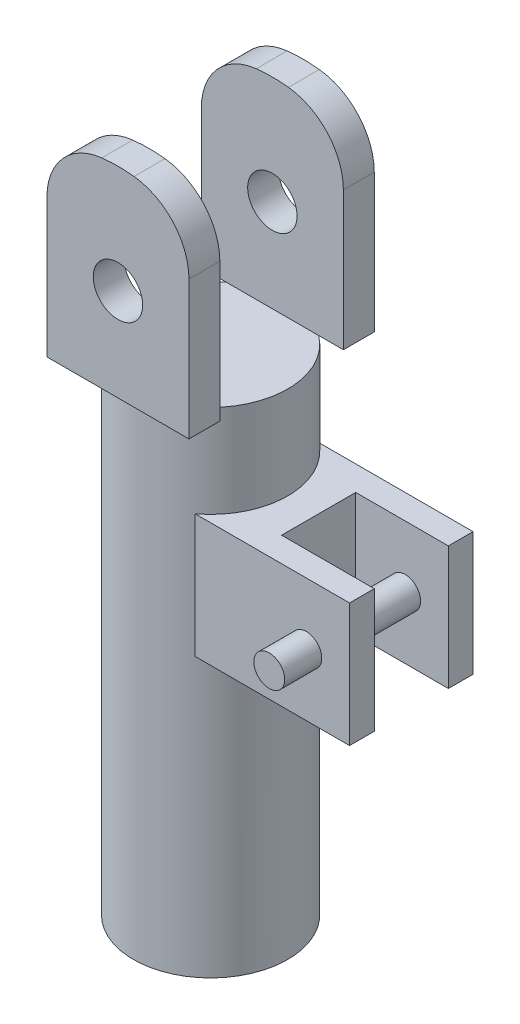
ISO-10303-21;
HEADER;
FILE_DESCRIPTION(('STEP AP214'),'2;1');
FILE_NAME('part.step','',(''),(''),'','','');
FILE_SCHEMA(('AUTOMOTIVE_DESIGN { 1 0 10303 214 1 1 1 1 }'));
ENDSEC;
DATA;
#1=APPLICATION_CONTEXT('core data for automotive mechanical design processes');
#2=APPLICATION_PROTOCOL_DEFINITION('international standard','automotive_design',2000,#1);
#3=PRODUCT_CONTEXT('',#1,'mechanical');
#4=PRODUCT('Part','Part','',(#3));
#5=PRODUCT_RELATED_PRODUCT_CATEGORY('part','',(#4));
#6=PRODUCT_DEFINITION_FORMATION('','',#4);
#7=PRODUCT_DEFINITION_CONTEXT('part definition',#1,'design');
#8=PRODUCT_DEFINITION('design','',#6,#7);
#9=PRODUCT_DEFINITION_SHAPE('','',#8);
#10=(LENGTH_UNIT() NAMED_UNIT(*) SI_UNIT(.MILLI.,.METRE.));
#11=(NAMED_UNIT(*) PLANE_ANGLE_UNIT() SI_UNIT($,.RADIAN.));
#12=(NAMED_UNIT(*) SI_UNIT($,.STERADIAN.) SOLID_ANGLE_UNIT());
#13=UNCERTAINTY_MEASURE_WITH_UNIT(LENGTH_MEASURE(1.E-05),#10,'distance_accuracy_value','');
#14=(GEOMETRIC_REPRESENTATION_CONTEXT(3) GLOBAL_UNCERTAINTY_ASSIGNED_CONTEXT((#13)) GLOBAL_UNIT_ASSIGNED_CONTEXT((#10,
#11,#12)) REPRESENTATION_CONTEXT('',''));
#15=CARTESIAN_POINT('',(0.,0.,0.));
#16=DIRECTION('',(0.,0.,1.));
#17=DIRECTION('',(1.,0.,0.));
#18=AXIS2_PLACEMENT_3D('',#15,#16,#17);
#19=CARTESIAN_POINT('',(32.5,0.,10.));
#20=DIRECTION('',(-1.,0.,0.));
#21=DIRECTION('',(0.,0.,1.));
#22=AXIS2_PLACEMENT_3D('',#19,#20,#21);
#23=PLANE('',#22);
#24=DIRECTION('',(0.,0.,-1.));
#25=VECTOR('',#24,1.);
#26=CARTESIAN_POINT('',(32.5,0.,10.));
#27=LINE('',#26,#25);
#28=CARTESIAN_POINT('',(32.5,0.,10.));
#29=VERTEX_POINT('',#28);
#30=CARTESIAN_POINT('',(32.5,0.,6.));
#31=VERTEX_POINT('',#30);
#32=EDGE_CURVE('E232',#29,#31,#27,.T.);
#33=ORIENTED_EDGE('',*,*,#32,.T.);
#34=DIRECTION('',(0.,1.,0.));
#35=VECTOR('',#34,1.);
#36=CARTESIAN_POINT('',(32.5,0.,6.));
#37=LINE('',#36,#35);
#38=CARTESIAN_POINT('',(32.5,20.,6.));
#39=VERTEX_POINT('',#38);
#40=EDGE_CURVE('E217',#31,#39,#37,.T.);
#41=ORIENTED_EDGE('',*,*,#40,.T.);
#42=DIRECTION('',(0.,0.,-1.));
#43=VECTOR('',#42,1.);
#44=CARTESIAN_POINT('',(32.5,20.,10.));
#45=LINE('',#44,#43);
#46=CARTESIAN_POINT('',(32.5,20.,10.));
#47=VERTEX_POINT('',#46);
#48=EDGE_CURVE('E229',#47,#39,#45,.T.);
#49=ORIENTED_EDGE('',*,*,#48,.F.);
#50=DIRECTION('',(0.,1.,0.));
#51=VECTOR('',#50,1.);
#52=CARTESIAN_POINT('',(32.5,0.,10.));
#53=LINE('',#52,#51);
#54=EDGE_CURVE('E223',#29,#47,#53,.T.);
#55=ORIENTED_EDGE('',*,*,#54,.F.);
#56=EDGE_LOOP('',(#33,#41,#49,#55));
#57=FACE_BOUND('',#56,.T.);
#58=ADVANCED_FACE('F34',(#57),#23,.F.);
#59=CARTESIAN_POINT('',(0.,35.,0.));
#60=DIRECTION('',(0.,-1.,0.));
#61=DIRECTION('',(0.,0.,-1.));
#62=AXIS2_PLACEMENT_3D('',#59,#60,#61);
#63=CYLINDRICAL_SURFACE('',#62,12.5);
#64=CARTESIAN_POINT('',(0.,-45.,0.));
#65=DIRECTION('',(0.,-1.,0.));
#66=DIRECTION('',(0.,0.,-1.));
#67=AXIS2_PLACEMENT_3D('',#64,#65,#66);
#68=CIRCLE('',#67,12.5);
#69=CARTESIAN_POINT('',(0.,-45.,-12.5));
#70=VERTEX_POINT('',#69);
#71=EDGE_CURVE('E254',#70,#70,#68,.T.);
#72=ORIENTED_EDGE('',*,*,#71,.F.);
#73=EDGE_LOOP('',(#72));
#74=FACE_BOUND('',#73,.T.);
#75=CARTESIAN_POINT('',(0.,35.,0.));
#76=DIRECTION('',(0.,1.,0.));
#77=DIRECTION('',(0.,0.,1.));
#78=AXIS2_PLACEMENT_3D('',#75,#76,#77);
#79=CIRCLE('',#78,12.5);
#80=CARTESIAN_POINT('',(7.5,35.,10.));
#81=VERTEX_POINT('',#80);
#82=CARTESIAN_POINT('',(7.5,35.,-10.));
#83=VERTEX_POINT('',#82);
#84=EDGE_CURVE('E11',#81,#83,#79,.T.);
#85=ORIENTED_EDGE('',*,*,#84,.F.);
#86=CARTESIAN_POINT('',(-7.5,35.,10.));
#87=VERTEX_POINT('',#86);
#88=EDGE_CURVE('E357',#87,#81,#79,.T.);
#89=ORIENTED_EDGE('',*,*,#88,.F.);
#90=CARTESIAN_POINT('',(-7.5,35.,-10.));
#91=VERTEX_POINT('',#90);
#92=EDGE_CURVE('E45',#91,#87,#79,.T.);
#93=ORIENTED_EDGE('',*,*,#92,.F.);
#94=EDGE_CURVE('E43',#83,#91,#79,.T.);
#95=ORIENTED_EDGE('',*,*,#94,.F.);
#96=EDGE_LOOP('',(#85,#89,#93,#95));
#97=FACE_BOUND('',#96,.T.);
#98=DIRECTION('',(0.,-1.,0.));
#99=VECTOR('',#98,1.);
#100=CARTESIAN_POINT('',(7.5,35.,-10.));
#101=LINE('',#100,#99);
#102=CARTESIAN_POINT('',(7.5,20.,-10.));
#103=VERTEX_POINT('',#102);
#104=CARTESIAN_POINT('',(7.5,0.,-10.));
#105=VERTEX_POINT('',#104);
#106=EDGE_CURVE('E236',#103,#105,#101,.T.);
#107=ORIENTED_EDGE('',*,*,#106,.T.);
#108=CARTESIAN_POINT('',(0.,0.,0.));
#109=DIRECTION('',(0.,1.,0.));
#110=DIRECTION('',(0.,0.,1.));
#111=AXIS2_PLACEMENT_3D('',#108,#109,#110);
#112=CIRCLE('',#111,12.5);
#113=CARTESIAN_POINT('',(7.5,0.,10.));
#114=VERTEX_POINT('',#113);
#115=EDGE_CURVE('E238',#105,#114,#112,.F.);
#116=ORIENTED_EDGE('',*,*,#115,.T.);
#117=DIRECTION('',(0.,-1.,0.));
#118=VECTOR('',#117,1.);
#119=CARTESIAN_POINT('',(7.5,35.,10.));
#120=LINE('',#119,#118);
#121=CARTESIAN_POINT('',(7.5,20.,10.));
#122=VERTEX_POINT('',#121);
#123=EDGE_CURVE('E235',#114,#122,#120,.F.);
#124=ORIENTED_EDGE('',*,*,#123,.T.);
#125=CARTESIAN_POINT('',(0.,20.,0.));
#126=DIRECTION('',(0.,-1.,0.));
#127=DIRECTION('',(0.,0.,-1.));
#128=AXIS2_PLACEMENT_3D('',#125,#126,#127);
#129=CIRCLE('',#128,12.5);
#130=EDGE_CURVE('E60',#122,#103,#129,.F.);
#131=ORIENTED_EDGE('',*,*,#130,.T.);
#132=EDGE_LOOP('',(#107,#116,#124,#131));
#133=FACE_BOUND('',#132,.T.);
#134=ADVANCED_FACE('F36',(#74,#97,#133),#63,.T.);
#135=CARTESIAN_POINT('',(1.5,57.4166666666667,15.));
#136=DIRECTION('',(0.,0.,-1.));
#137=DIRECTION('',(-1.,0.,0.));
#138=AXIS2_PLACEMENT_3D('',#135,#136,#137);
#139=CYLINDRICAL_SURFACE('',#138,10.);
#140=DIRECTION('',(0.,0.,-1.));
#141=VECTOR('',#140,1.);
#142=CARTESIAN_POINT('',(11.5,57.4166666666667,15.));
#143=LINE('',#142,#141);
#144=CARTESIAN_POINT('',(11.5,57.4166666666667,15.));
#145=VERTEX_POINT('',#144);
#146=CARTESIAN_POINT('',(11.5,57.4166666666667,10.));
#147=VERTEX_POINT('',#146);
#148=EDGE_CURVE('E335',#145,#147,#143,.T.);
#149=ORIENTED_EDGE('',*,*,#148,.T.);
#150=CARTESIAN_POINT('',(1.5,57.4166666666667,10.));
#151=DIRECTION('',(0.,0.,1.));
#152=DIRECTION('',(1.,0.,0.));
#153=AXIS2_PLACEMENT_3D('',#150,#151,#152);
#154=CIRCLE('',#153,10.);
#155=CARTESIAN_POINT('',(2.6076923076923,67.3551282051282,10.));
#156=VERTEX_POINT('',#155);
#157=EDGE_CURVE('E291',#147,#156,#154,.T.);
#158=ORIENTED_EDGE('',*,*,#157,.T.);
#159=DIRECTION('',(0.,0.,-1.));
#160=VECTOR('',#159,1.);
#161=CARTESIAN_POINT('',(2.6076923076923,67.3551282051282,15.));
#162=LINE('',#161,#160);
#163=CARTESIAN_POINT('',(2.6076923076923,67.3551282051282,15.));
#164=VERTEX_POINT('',#163);
#165=EDGE_CURVE('E355',#164,#156,#162,.T.);
#166=ORIENTED_EDGE('',*,*,#165,.F.);
#167=CARTESIAN_POINT('',(1.5,57.4166666666667,15.));
#168=DIRECTION('',(0.,0.,1.));
#169=DIRECTION('',(-1.,0.,0.));
#170=AXIS2_PLACEMENT_3D('',#167,#168,#169);
#171=CIRCLE('',#170,10.);
#172=EDGE_CURVE('E304',#145,#164,#171,.T.);
#173=ORIENTED_EDGE('',*,*,#172,.F.);
#174=EDGE_LOOP('',(#149,#158,#166,#173));
#175=FACE_BOUND('',#174,.T.);
#176=ADVANCED_FACE('F397',(#175),#139,.T.);
#177=CARTESIAN_POINT('',(0.,43.9583333333333,15.));
#178=DIRECTION('',(0.,0.,-1.));
#179=DIRECTION('',(-1.,0.,0.));
#180=AXIS2_PLACEMENT_3D('',#177,#178,#179);
#181=CYLINDRICAL_SURFACE('',#180,23.5416666666667);
#182=ORIENTED_EDGE('',*,*,#165,.T.);
#183=CARTESIAN_POINT('',(0.,43.9583333333333,10.));
#184=DIRECTION('',(0.,0.,1.));
#185=DIRECTION('',(1.,0.,0.));
#186=AXIS2_PLACEMENT_3D('',#183,#184,#185);
#187=CIRCLE('',#186,23.5416666666667);
#188=CARTESIAN_POINT('',(-2.60769230769231,67.3551282051282,10.));
#189=VERTEX_POINT('',#188);
#190=EDGE_CURVE('E289',#156,#189,#187,.T.);
#191=ORIENTED_EDGE('',*,*,#190,.T.);
#192=DIRECTION('',(0.,0.,-1.));
#193=VECTOR('',#192,1.);
#194=CARTESIAN_POINT('',(-2.60769230769231,67.3551282051282,15.));
#195=LINE('',#194,#193);
#196=CARTESIAN_POINT('',(-2.60769230769231,67.3551282051282,15.));
#197=VERTEX_POINT('',#196);
#198=EDGE_CURVE('E351',#197,#189,#195,.T.);
#199=ORIENTED_EDGE('',*,*,#198,.F.);
#200=CARTESIAN_POINT('',(0.,43.9583333333333,15.));
#201=DIRECTION('',(0.,0.,1.));
#202=DIRECTION('',(-1.,0.,0.));
#203=AXIS2_PLACEMENT_3D('',#200,#201,#202);
#204=CIRCLE('',#203,23.5416666666667);
#205=EDGE_CURVE('E307',#164,#197,#204,.T.);
#206=ORIENTED_EDGE('',*,*,#205,.F.);
#207=EDGE_LOOP('',(#182,#191,#199,#206));
#208=FACE_BOUND('',#207,.T.);
#209=ADVANCED_FACE('F412',(#208),#181,.T.);
#210=CARTESIAN_POINT('',(-1.5,57.4166666666667,15.));
#211=DIRECTION('',(0.,0.,-1.));
#212=DIRECTION('',(-1.,0.,0.));
#213=AXIS2_PLACEMENT_3D('',#210,#211,#212);
#214=CYLINDRICAL_SURFACE('',#213,10.);
#215=ORIENTED_EDGE('',*,*,#198,.T.);
#216=CARTESIAN_POINT('',(-1.5,57.4166666666667,10.));
#217=DIRECTION('',(0.,0.,1.));
#218=DIRECTION('',(1.,0.,0.));
#219=AXIS2_PLACEMENT_3D('',#216,#217,#218);
#220=CIRCLE('',#219,10.);
#221=CARTESIAN_POINT('',(-11.5,57.4166666666667,10.));
#222=VERTEX_POINT('',#221);
#223=EDGE_CURVE('E286',#189,#222,#220,.T.);
#224=ORIENTED_EDGE('',*,*,#223,.T.);
#225=DIRECTION('',(0.,0.,-1.));
#226=VECTOR('',#225,1.);
#227=CARTESIAN_POINT('',(-11.5,57.4166666666667,15.));
#228=LINE('',#227,#226);
#229=CARTESIAN_POINT('',(-11.5,57.4166666666667,15.));
#230=VERTEX_POINT('',#229);
#231=EDGE_CURVE('E347',#230,#222,#228,.T.);
#232=ORIENTED_EDGE('',*,*,#231,.F.);
#233=CARTESIAN_POINT('',(-1.5,57.4166666666667,15.));
#234=DIRECTION('',(0.,0.,1.));
#235=DIRECTION('',(1.,0.,0.));
#236=AXIS2_PLACEMENT_3D('',#233,#234,#235);
#237=CIRCLE('',#236,10.);
#238=EDGE_CURVE('E310',#197,#230,#237,.T.);
#239=ORIENTED_EDGE('',*,*,#238,.F.);
#240=EDGE_LOOP('',(#215,#224,#232,#239));
#241=FACE_BOUND('',#240,.T.);
#242=ADVANCED_FACE('F410',(#241),#214,.T.);
#243=CARTESIAN_POINT('',(-11.5,35.,15.));
#244=DIRECTION('',(1.,0.,0.));
#245=DIRECTION('',(0.,1.,0.));
#246=AXIS2_PLACEMENT_3D('',#243,#244,#245);
#247=PLANE('',#246);
#248=ORIENTED_EDGE('',*,*,#231,.T.);
#249=DIRECTION('',(0.,-1.,0.));
#250=VECTOR('',#249,1.);
#251=CARTESIAN_POINT('',(-11.5,35.,10.));
#252=LINE('',#251,#250);
#253=CARTESIAN_POINT('',(-11.5,35.,10.));
#254=VERTEX_POINT('',#253);
#255=EDGE_CURVE('E283',#222,#254,#252,.T.);
#256=ORIENTED_EDGE('',*,*,#255,.T.);
#257=DIRECTION('',(0.,0.,-1.));
#258=VECTOR('',#257,1.);
#259=CARTESIAN_POINT('',(-11.5,35.,15.));
#260=LINE('',#259,#258);
#261=CARTESIAN_POINT('',(-11.5,35.,15.));
#262=VERTEX_POINT('',#261);
#263=EDGE_CURVE('E343',#262,#254,#260,.T.);
#264=ORIENTED_EDGE('',*,*,#263,.F.);
#265=DIRECTION('',(0.,-1.,0.));
#266=VECTOR('',#265,1.);
#267=CARTESIAN_POINT('',(-11.5,35.,15.));
#268=LINE('',#267,#266);
#269=EDGE_CURVE('E312',#230,#262,#268,.T.);
#270=ORIENTED_EDGE('',*,*,#269,.F.);
#271=EDGE_LOOP('',(#248,#256,#264,#270));
#272=FACE_BOUND('',#271,.T.);
#273=ADVANCED_FACE('F407',(#272),#247,.F.);
#274=CARTESIAN_POINT('',(11.5,35.,15.));
#275=DIRECTION('',(-1.,0.,0.));
#276=DIRECTION('',(0.,-1.,0.));
#277=AXIS2_PLACEMENT_3D('',#274,#275,#276);
#278=PLANE('',#277);
#279=DIRECTION('',(0.,0.,-1.));
#280=VECTOR('',#279,1.);
#281=CARTESIAN_POINT('',(11.5,35.,15.));
#282=LINE('',#281,#280);
#283=CARTESIAN_POINT('',(11.5,35.,15.));
#284=VERTEX_POINT('',#283);
#285=CARTESIAN_POINT('',(11.5,35.,10.));
#286=VERTEX_POINT('',#285);
#287=EDGE_CURVE('E339',#284,#286,#282,.T.);
#288=ORIENTED_EDGE('',*,*,#287,.T.);
#289=DIRECTION('',(0.,-1.,0.));
#290=VECTOR('',#289,1.);
#291=CARTESIAN_POINT('',(11.5,67.5,10.));
#292=LINE('',#291,#290);
#293=EDGE_CURVE('E257',#147,#286,#292,.T.);
#294=ORIENTED_EDGE('',*,*,#293,.F.);
#295=ORIENTED_EDGE('',*,*,#148,.F.);
#296=DIRECTION('',(0.,1.,0.));
#297=VECTOR('',#296,1.);
#298=CARTESIAN_POINT('',(11.5,35.,15.));
#299=LINE('',#298,#297);
#300=EDGE_CURVE('E316',#284,#145,#299,.T.);
#301=ORIENTED_EDGE('',*,*,#300,.F.);
#302=EDGE_LOOP('',(#288,#294,#295,#301));
#303=FACE_BOUND('',#302,.T.);
#304=ADVANCED_FACE('F393',(#303),#278,.F.);
#305=CARTESIAN_POINT('',(0.,50.,15.));
#306=DIRECTION('',(0.,0.,-1.));
#307=DIRECTION('',(-1.,0.,0.));
#308=AXIS2_PLACEMENT_3D('',#305,#306,#307);
#309=CYLINDRICAL_SURFACE('',#308,4.00000000000001);
#310=CARTESIAN_POINT('',(0.,50.,10.));
#311=DIRECTION('',(0.,0.,1.));
#312=DIRECTION('',(1.,0.,0.));
#313=AXIS2_PLACEMENT_3D('',#310,#311,#312);
#314=CIRCLE('',#313,4.00000000000001);
#315=CARTESIAN_POINT('',(4.00000000000001,50.,10.));
#316=VERTEX_POINT('',#315);
#317=EDGE_CURVE('E38',#316,#316,#314,.T.);
#318=ORIENTED_EDGE('',*,*,#317,.F.);
#319=EDGE_LOOP('',(#318));
#320=FACE_BOUND('',#319,.T.);
#321=CARTESIAN_POINT('',(0.,50.,15.));
#322=DIRECTION('',(0.,0.,1.));
#323=DIRECTION('',(-1.,0.,0.));
#324=AXIS2_PLACEMENT_3D('',#321,#322,#323);
#325=CIRCLE('',#324,4.00000000000001);
#326=CARTESIAN_POINT('',(-4.00000000000001,50.,15.));
#327=VERTEX_POINT('',#326);
#328=EDGE_CURVE('E298',#327,#327,#325,.T.);
#329=ORIENTED_EDGE('',*,*,#328,.T.);
#330=EDGE_LOOP('',(#329));
#331=FACE_BOUND('',#330,.T.);
#332=ADVANCED_FACE('F485',(#320,#331),#309,.F.);
#333=CARTESIAN_POINT('',(0.,35.,0.));
#334=DIRECTION('',(0.,1.,0.));
#335=DIRECTION('',(0.,0.,1.));
#336=AXIS2_PLACEMENT_3D('',#333,#334,#335);
#337=PLANE('',#336);
#338=ORIENTED_EDGE('',*,*,#84,.T.);
#339=DIRECTION('',(1.,0.,0.));
#340=VECTOR('',#339,1.);
#341=CARTESIAN_POINT('',(-12.5,35.,-10.));
#342=LINE('',#341,#340);
#343=EDGE_CURVE('E264',#91,#83,#342,.T.);
#344=ORIENTED_EDGE('',*,*,#343,.F.);
#345=ORIENTED_EDGE('',*,*,#92,.T.);
#346=DIRECTION('',(1.,0.,0.));
#347=VECTOR('',#346,1.);
#348=CARTESIAN_POINT('',(-12.5,35.,10.));
#349=LINE('',#348,#347);
#350=EDGE_CURVE('E269',#87,#81,#349,.T.);
#351=ORIENTED_EDGE('',*,*,#350,.T.);
#352=EDGE_LOOP('',(#338,#344,#345,#351));
#353=FACE_BOUND('',#352,.T.);
#354=ADVANCED_FACE('F388',(#353),#337,.T.);
#355=CARTESIAN_POINT('',(-11.5,35.,15.));
#356=DIRECTION('',(0.,1.,0.));
#357=DIRECTION('',(0.,0.,1.));
#358=AXIS2_PLACEMENT_3D('',#355,#356,#357);
#359=PLANE('',#358);
#360=CARTESIAN_POINT('',(11.5,35.,-10.));
#361=VERTEX_POINT('',#360);
#362=CARTESIAN_POINT('',(11.5,35.,-15.));
#363=VERTEX_POINT('',#362);
#364=EDGE_CURVE('E338',#361,#363,#282,.T.);
#365=ORIENTED_EDGE('',*,*,#364,.F.);
#366=EDGE_CURVE('E262',#83,#361,#342,.T.);
#367=ORIENTED_EDGE('',*,*,#366,.F.);
#368=ORIENTED_EDGE('',*,*,#94,.T.);
#369=CARTESIAN_POINT('',(-11.5,35.,-10.));
#370=VERTEX_POINT('',#369);
#371=EDGE_CURVE('E266',#370,#91,#342,.T.);
#372=ORIENTED_EDGE('',*,*,#371,.F.);
#373=CARTESIAN_POINT('',(-11.5,35.,-15.));
#374=VERTEX_POINT('',#373);
#375=EDGE_CURVE('E342',#370,#374,#260,.T.);
#376=ORIENTED_EDGE('',*,*,#375,.T.);
#377=DIRECTION('',(1.,0.,0.));
#378=VECTOR('',#377,1.);
#379=CARTESIAN_POINT('',(-11.5,35.,-15.));
#380=LINE('',#379,#378);
#381=EDGE_CURVE('E330',#374,#363,#380,.T.);
#382=ORIENTED_EDGE('',*,*,#381,.T.);
#383=EDGE_LOOP('',(#365,#367,#368,#372,#376,#382));
#384=FACE_BOUND('',#383,.T.);
#385=ADVANCED_FACE('F374',(#384),#359,.F.);
#386=ORIENTED_EDGE('',*,*,#263,.T.);
#387=EDGE_CURVE('E265',#254,#87,#349,.T.);
#388=ORIENTED_EDGE('',*,*,#387,.T.);
#389=ORIENTED_EDGE('',*,*,#88,.T.);
#390=EDGE_CURVE('E261',#81,#286,#349,.T.);
#391=ORIENTED_EDGE('',*,*,#390,.T.);
#392=ORIENTED_EDGE('',*,*,#287,.F.);
#393=DIRECTION('',(1.,0.,0.));
#394=VECTOR('',#393,1.);
#395=CARTESIAN_POINT('',(-11.5,35.,15.));
#396=LINE('',#395,#394);
#397=EDGE_CURVE('E314',#262,#284,#396,.T.);
#398=ORIENTED_EDGE('',*,*,#397,.F.);
#399=EDGE_LOOP('',(#386,#388,#389,#391,#392,#398));
#400=FACE_BOUND('',#399,.T.);
#401=ADVANCED_FACE('F381',(#400),#359,.F.);
#402=CARTESIAN_POINT('',(1.5,57.4166666666667,15.));
#403=DIRECTION('',(0.,0.,-1.));
#404=DIRECTION('',(-1.,0.,0.));
#405=AXIS2_PLACEMENT_3D('',#402,#403,#404);
#406=PLANE('',#405);
#407=ORIENTED_EDGE('',*,*,#172,.T.);
#408=ORIENTED_EDGE('',*,*,#205,.T.);
#409=ORIENTED_EDGE('',*,*,#238,.T.);
#410=ORIENTED_EDGE('',*,*,#269,.T.);
#411=ORIENTED_EDGE('',*,*,#397,.T.);
#412=ORIENTED_EDGE('',*,*,#300,.T.);
#413=EDGE_LOOP('',(#407,#408,#409,#410,#411,#412));
#414=FACE_BOUND('',#413,.T.);
#415=ORIENTED_EDGE('',*,*,#328,.F.);
#416=EDGE_LOOP('',(#415));
#417=FACE_BOUND('',#416,.T.);
#418=ADVANCED_FACE('F400',(#414,#417),#406,.F.);
#419=CARTESIAN_POINT('',(1.5,57.4166666666667,-15.));
#420=DIRECTION('',(0.,0.,-1.));
#421=DIRECTION('',(-1.,0.,0.));
#422=AXIS2_PLACEMENT_3D('',#419,#420,#421);
#423=PLANE('',#422);
#424=CARTESIAN_POINT('',(1.5,57.4166666666667,-15.));
#425=DIRECTION('',(0.,0.,1.));
#426=DIRECTION('',(-1.,0.,0.));
#427=AXIS2_PLACEMENT_3D('',#424,#425,#426);
#428=CIRCLE('',#427,10.);
#429=CARTESIAN_POINT('',(11.5,57.4166666666667,-15.));
#430=VERTEX_POINT('',#429);
#431=CARTESIAN_POINT('',(2.6076923076923,67.3551282051282,-15.));
#432=VERTEX_POINT('',#431);
#433=EDGE_CURVE('E301',#430,#432,#428,.T.);
#434=ORIENTED_EDGE('',*,*,#433,.F.);
#435=DIRECTION('',(0.,1.,0.));
#436=VECTOR('',#435,1.);
#437=CARTESIAN_POINT('',(11.5,35.,-15.));
#438=LINE('',#437,#436);
#439=EDGE_CURVE('E308',#363,#430,#438,.T.);
#440=ORIENTED_EDGE('',*,*,#439,.F.);
#441=ORIENTED_EDGE('',*,*,#381,.F.);
#442=DIRECTION('',(0.,-1.,0.));
#443=VECTOR('',#442,1.);
#444=CARTESIAN_POINT('',(-11.5,35.,-15.));
#445=LINE('',#444,#443);
#446=CARTESIAN_POINT('',(-11.5,57.4166666666667,-15.));
#447=VERTEX_POINT('',#446);
#448=EDGE_CURVE('E327',#447,#374,#445,.T.);
#449=ORIENTED_EDGE('',*,*,#448,.F.);
#450=CARTESIAN_POINT('',(-1.5,57.4166666666667,-15.));
#451=DIRECTION('',(0.,0.,1.));
#452=DIRECTION('',(1.,0.,0.));
#453=AXIS2_PLACEMENT_3D('',#450,#451,#452);
#454=CIRCLE('',#453,10.);
#455=CARTESIAN_POINT('',(-2.60769230769231,67.3551282051282,-15.));
#456=VERTEX_POINT('',#455);
#457=EDGE_CURVE('E324',#456,#447,#454,.T.);
#458=ORIENTED_EDGE('',*,*,#457,.F.);
#459=CARTESIAN_POINT('',(0.,43.9583333333333,-15.));
#460=DIRECTION('',(0.,0.,1.));
#461=DIRECTION('',(-1.,0.,0.));
#462=AXIS2_PLACEMENT_3D('',#459,#460,#461);
#463=CIRCLE('',#462,23.5416666666667);
#464=EDGE_CURVE('E321',#432,#456,#463,.T.);
#465=ORIENTED_EDGE('',*,*,#464,.F.);
#466=EDGE_LOOP('',(#434,#440,#441,#449,#458,#465));
#467=FACE_BOUND('',#466,.T.);
#468=CARTESIAN_POINT('',(0.,50.,-15.));
#469=DIRECTION('',(0.,0.,1.));
#470=DIRECTION('',(-1.,0.,0.));
#471=AXIS2_PLACEMENT_3D('',#468,#469,#470);
#472=CIRCLE('',#471,4.00000000000001);
#473=CARTESIAN_POINT('',(-4.00000000000001,50.,-15.));
#474=VERTEX_POINT('',#473);
#475=EDGE_CURVE('E297',#474,#474,#472,.T.);
#476=ORIENTED_EDGE('',*,*,#475,.T.);
#477=EDGE_LOOP('',(#476));
#478=FACE_BOUND('',#477,.T.);
#479=ADVANCED_FACE('F488',(#467,#478),#423,.T.);
#480=CARTESIAN_POINT('',(2.6076923076923,67.3551282051282,-10.));
#481=VERTEX_POINT('',#480);
#482=EDGE_CURVE('E354',#481,#432,#162,.T.);
#483=ORIENTED_EDGE('',*,*,#482,.F.);
#484=CARTESIAN_POINT('',(1.5,57.4166666666667,-10.));
#485=DIRECTION('',(0.,0.,-1.));
#486=DIRECTION('',(-1.,0.,0.));
#487=AXIS2_PLACEMENT_3D('',#484,#485,#486);
#488=CIRCLE('',#487,10.);
#489=CARTESIAN_POINT('',(11.5,57.4166666666667,-10.));
#490=VERTEX_POINT('',#489);
#491=EDGE_CURVE('E280',#481,#490,#488,.T.);
#492=ORIENTED_EDGE('',*,*,#491,.T.);
#493=EDGE_CURVE('E318',#490,#430,#143,.T.);
#494=ORIENTED_EDGE('',*,*,#493,.T.);
#495=ORIENTED_EDGE('',*,*,#433,.T.);
#496=EDGE_LOOP('',(#483,#492,#494,#495));
#497=FACE_BOUND('',#496,.T.);
#498=ADVANCED_FACE('F423',(#497),#139,.T.);
#499=CARTESIAN_POINT('',(-2.60769230769231,67.3551282051282,-10.));
#500=VERTEX_POINT('',#499);
#501=EDGE_CURVE('E350',#500,#456,#195,.T.);
#502=ORIENTED_EDGE('',*,*,#501,.F.);
#503=CARTESIAN_POINT('',(0.,43.9583333333333,-10.));
#504=DIRECTION('',(0.,0.,-1.));
#505=DIRECTION('',(-1.,0.,0.));
#506=AXIS2_PLACEMENT_3D('',#503,#504,#505);
#507=CIRCLE('',#506,23.5416666666667);
#508=EDGE_CURVE('E277',#500,#481,#507,.T.);
#509=ORIENTED_EDGE('',*,*,#508,.T.);
#510=ORIENTED_EDGE('',*,*,#482,.T.);
#511=ORIENTED_EDGE('',*,*,#464,.T.);
#512=EDGE_LOOP('',(#502,#509,#510,#511));
#513=FACE_BOUND('',#512,.T.);
#514=ADVANCED_FACE('F415',(#513),#181,.T.);
#515=CARTESIAN_POINT('',(-11.5,57.4166666666667,-10.));
#516=VERTEX_POINT('',#515);
#517=EDGE_CURVE('E346',#516,#447,#228,.T.);
#518=ORIENTED_EDGE('',*,*,#517,.F.);
#519=CARTESIAN_POINT('',(-1.5,57.4166666666667,-10.));
#520=DIRECTION('',(0.,0.,-1.));
#521=DIRECTION('',(-1.,0.,0.));
#522=AXIS2_PLACEMENT_3D('',#519,#520,#521);
#523=CIRCLE('',#522,10.);
#524=EDGE_CURVE('E273',#516,#500,#523,.T.);
#525=ORIENTED_EDGE('',*,*,#524,.T.);
#526=ORIENTED_EDGE('',*,*,#501,.T.);
#527=ORIENTED_EDGE('',*,*,#457,.T.);
#528=EDGE_LOOP('',(#518,#525,#526,#527));
#529=FACE_BOUND('',#528,.T.);
#530=ADVANCED_FACE('F421',(#529),#214,.T.);
#531=ORIENTED_EDGE('',*,*,#375,.F.);
#532=DIRECTION('',(0.,1.,0.));
#533=VECTOR('',#532,1.);
#534=CARTESIAN_POINT('',(-11.5,35.,-10.));
#535=LINE('',#534,#533);
#536=EDGE_CURVE('E270',#370,#516,#535,.T.);
#537=ORIENTED_EDGE('',*,*,#536,.T.);
#538=ORIENTED_EDGE('',*,*,#517,.T.);
#539=ORIENTED_EDGE('',*,*,#448,.T.);
#540=EDGE_LOOP('',(#531,#537,#538,#539));
#541=FACE_BOUND('',#540,.T.);
#542=ADVANCED_FACE('F494',(#541),#247,.F.);
#543=ORIENTED_EDGE('',*,*,#493,.F.);
#544=DIRECTION('',(0.,1.,0.));
#545=VECTOR('',#544,1.);
#546=CARTESIAN_POINT('',(11.5,67.5,-10.));
#547=LINE('',#546,#545);
#548=EDGE_CURVE('E259',#361,#490,#547,.T.);
#549=ORIENTED_EDGE('',*,*,#548,.F.);
#550=ORIENTED_EDGE('',*,*,#364,.T.);
#551=ORIENTED_EDGE('',*,*,#439,.T.);
#552=EDGE_LOOP('',(#543,#549,#550,#551));
#553=FACE_BOUND('',#552,.T.);
#554=ADVANCED_FACE('F483',(#553),#278,.F.);
#555=CARTESIAN_POINT('',(0.,50.,-10.));
#556=DIRECTION('',(0.,0.,-1.));
#557=DIRECTION('',(-1.,0.,0.));
#558=AXIS2_PLACEMENT_3D('',#555,#556,#557);
#559=CIRCLE('',#558,4.00000000000001);
#560=CARTESIAN_POINT('',(-4.00000000000001,50.,-10.));
#561=VERTEX_POINT('',#560);
#562=EDGE_CURVE('E274',#561,#561,#559,.T.);
#563=ORIENTED_EDGE('',*,*,#562,.F.);
#564=EDGE_LOOP('',(#563));
#565=FACE_BOUND('',#564,.T.);
#566=ORIENTED_EDGE('',*,*,#475,.F.);
#567=EDGE_LOOP('',(#566));
#568=FACE_BOUND('',#567,.T.);
#569=ADVANCED_FACE('F476',(#565,#568),#309,.F.);
#570=CARTESIAN_POINT('',(-12.5,67.5,10.));
#571=DIRECTION('',(0.,0.,1.));
#572=DIRECTION('',(1.,0.,0.));
#573=AXIS2_PLACEMENT_3D('',#570,#571,#572);
#574=PLANE('',#573);
#575=ORIENTED_EDGE('',*,*,#317,.T.);
#576=EDGE_LOOP('',(#575));
#577=FACE_BOUND('',#576,.T.);
#578=ORIENTED_EDGE('',*,*,#293,.T.);
#579=ORIENTED_EDGE('',*,*,#390,.F.);
#580=ORIENTED_EDGE('',*,*,#350,.F.);
#581=ORIENTED_EDGE('',*,*,#387,.F.);
#582=ORIENTED_EDGE('',*,*,#255,.F.);
#583=ORIENTED_EDGE('',*,*,#223,.F.);
#584=ORIENTED_EDGE('',*,*,#190,.F.);
#585=ORIENTED_EDGE('',*,*,#157,.F.);
#586=EDGE_LOOP('',(#578,#579,#580,#581,#582,#583,#584,#585));
#587=FACE_BOUND('',#586,.T.);
#588=ADVANCED_FACE('F389',(#577,#587),#574,.F.);
#589=CARTESIAN_POINT('',(-12.5,67.5,-10.));
#590=DIRECTION('',(0.,0.,-1.));
#591=DIRECTION('',(-1.,0.,0.));
#592=AXIS2_PLACEMENT_3D('',#589,#590,#591);
#593=PLANE('',#592);
#594=ORIENTED_EDGE('',*,*,#562,.T.);
#595=EDGE_LOOP('',(#594));
#596=FACE_BOUND('',#595,.T.);
#597=ORIENTED_EDGE('',*,*,#508,.F.);
#598=ORIENTED_EDGE('',*,*,#524,.F.);
#599=ORIENTED_EDGE('',*,*,#536,.F.);
#600=ORIENTED_EDGE('',*,*,#371,.T.);
#601=ORIENTED_EDGE('',*,*,#343,.T.);
#602=ORIENTED_EDGE('',*,*,#366,.T.);
#603=ORIENTED_EDGE('',*,*,#548,.T.);
#604=ORIENTED_EDGE('',*,*,#491,.F.);
#605=EDGE_LOOP('',(#597,#598,#599,#600,#601,#602,#603,#604));
#606=FACE_BOUND('',#605,.T.);
#607=ADVANCED_FACE('F368',(#596,#606),#593,.F.);
#608=CARTESIAN_POINT('',(0.,-45.,0.));
#609=DIRECTION('',(0.,-1.,0.));
#610=DIRECTION('',(0.,0.,-1.));
#611=AXIS2_PLACEMENT_3D('',#608,#609,#610);
#612=PLANE('',#611);
#613=ORIENTED_EDGE('',*,*,#71,.T.);
#614=EDGE_LOOP('',(#613));
#615=FACE_BOUND('',#614,.T.);
#616=CARTESIAN_POINT('',(0.,-45.,0.));
#617=DIRECTION('',(0.,-1.,0.));
#618=DIRECTION('',(0.,0.,-1.));
#619=AXIS2_PLACEMENT_3D('',#616,#617,#618);
#620=CIRCLE('',#619,10.);
#621=CARTESIAN_POINT('',(0.,-45.,-10.));
#622=VERTEX_POINT('',#621);
#623=EDGE_CURVE('E242',#622,#622,#620,.T.);
#624=ORIENTED_EDGE('',*,*,#623,.F.);
#625=EDGE_LOOP('',(#624));
#626=FACE_BOUND('',#625,.T.);
#627=ADVANCED_FACE('F468',(#615,#626),#612,.T.);
#628=CARTESIAN_POINT('',(0.,30.,0.));
#629=DIRECTION('',(0.,-1.,0.));
#630=DIRECTION('',(0.,0.,-1.));
#631=AXIS2_PLACEMENT_3D('',#628,#629,#630);
#632=PLANE('',#631);
#633=CARTESIAN_POINT('',(0.,30.,0.));
#634=DIRECTION('',(0.,-1.,0.));
#635=DIRECTION('',(0.,0.,-1.));
#636=AXIS2_PLACEMENT_3D('',#633,#634,#635);
#637=CIRCLE('',#636,10.);
#638=CARTESIAN_POINT('',(0.,30.,-10.));
#639=VERTEX_POINT('',#638);
#640=EDGE_CURVE('E294',#639,#639,#637,.T.);
#641=ORIENTED_EDGE('',*,*,#640,.T.);
#642=EDGE_LOOP('',(#641));
#643=FACE_BOUND('',#642,.T.);
#644=ADVANCED_FACE('F460',(#643),#632,.T.);
#645=CARTESIAN_POINT('',(0.,30.,0.));
#646=DIRECTION('',(0.,-1.,0.));
#647=DIRECTION('',(0.,0.,-1.));
#648=AXIS2_PLACEMENT_3D('',#645,#646,#647);
#649=CYLINDRICAL_SURFACE('',#648,10.);
#650=ORIENTED_EDGE('',*,*,#640,.F.);
#651=EDGE_LOOP('',(#650));
#652=FACE_BOUND('',#651,.T.);
#653=ORIENTED_EDGE('',*,*,#623,.T.);
#654=EDGE_LOOP('',(#653));
#655=FACE_BOUND('',#654,.T.);
#656=ADVANCED_FACE('F448',(#652,#655),#649,.F.);
#657=CARTESIAN_POINT('',(-12.502,20.,-10.));
#658=DIRECTION('',(0.,0.,1.));
#659=DIRECTION('',(1.,0.,0.));
#660=AXIS2_PLACEMENT_3D('',#657,#658,#659);
#661=PLANE('',#660);
#662=CARTESIAN_POINT('',(25.5,10.,-10.));
#663=DIRECTION('',(0.,0.,1.));
#664=DIRECTION('',(1.,0.,0.));
#665=AXIS2_PLACEMENT_3D('',#662,#663,#664);
#666=CIRCLE('',#665,2.5);
#667=CARTESIAN_POINT('',(28.,10.,-10.));
#668=VERTEX_POINT('',#667);
#669=EDGE_CURVE('E211',#668,#668,#666,.T.);
#670=ORIENTED_EDGE('',*,*,#669,.T.);
#671=EDGE_LOOP('',(#670));
#672=FACE_BOUND('',#671,.T.);
#673=ORIENTED_EDGE('',*,*,#106,.F.);
#674=DIRECTION('',(1.,0.,0.));
#675=VECTOR('',#674,1.);
#676=CARTESIAN_POINT('',(-12.502,20.,-10.));
#677=LINE('',#676,#675);
#678=CARTESIAN_POINT('',(32.5,20.,-10.));
#679=VERTEX_POINT('',#678);
#680=EDGE_CURVE('E247',#103,#679,#677,.T.);
#681=ORIENTED_EDGE('',*,*,#680,.T.);
#682=DIRECTION('',(0.,1.,0.));
#683=VECTOR('',#682,1.);
#684=CARTESIAN_POINT('',(32.5,0.,-10.));
#685=LINE('',#684,#683);
#686=CARTESIAN_POINT('',(32.5,0.,-10.));
#687=VERTEX_POINT('',#686);
#688=EDGE_CURVE('E220',#687,#679,#685,.T.);
#689=ORIENTED_EDGE('',*,*,#688,.F.);
#690=DIRECTION('',(1.,0.,0.));
#691=VECTOR('',#690,1.);
#692=CARTESIAN_POINT('',(-12.502,0.,-10.));
#693=LINE('',#692,#691);
#694=EDGE_CURVE('E245',#105,#687,#693,.T.);
#695=ORIENTED_EDGE('',*,*,#694,.F.);
#696=EDGE_LOOP('',(#673,#681,#689,#695));
#697=FACE_BOUND('',#696,.T.);
#698=ADVANCED_FACE('F440',(#672,#697),#661,.F.);
#699=CARTESIAN_POINT('',(-12.502,20.,10.));
#700=DIRECTION('',(0.,-1.,0.));
#701=DIRECTION('',(0.,0.,-1.));
#702=AXIS2_PLACEMENT_3D('',#699,#700,#701);
#703=PLANE('',#702);
#704=ORIENTED_EDGE('',*,*,#48,.T.);
#705=DIRECTION('',(1.,0.,0.));
#706=VECTOR('',#705,1.);
#707=CARTESIAN_POINT('',(32.5,20.,6.));
#708=LINE('',#707,#706);
#709=CARTESIAN_POINT('',(17.5,20.,6.));
#710=VERTEX_POINT('',#709);
#711=EDGE_CURVE('E206',#710,#39,#708,.T.);
#712=ORIENTED_EDGE('',*,*,#711,.F.);
#713=DIRECTION('',(0.,0.,1.));
#714=VECTOR('',#713,1.);
#715=CARTESIAN_POINT('',(17.5,20.,-6.));
#716=LINE('',#715,#714);
#717=CARTESIAN_POINT('',(17.5,20.,-6.));
#718=VERTEX_POINT('',#717);
#719=EDGE_CURVE('E208',#718,#710,#716,.T.);
#720=ORIENTED_EDGE('',*,*,#719,.F.);
#721=DIRECTION('',(-1.,0.,0.));
#722=VECTOR('',#721,1.);
#723=CARTESIAN_POINT('',(32.5,20.,-6.));
#724=LINE('',#723,#722);
#725=CARTESIAN_POINT('',(32.5,20.,-6.));
#726=VERTEX_POINT('',#725);
#727=EDGE_CURVE('E187',#726,#718,#724,.T.);
#728=ORIENTED_EDGE('',*,*,#727,.F.);
#729=EDGE_CURVE('E226',#726,#679,#45,.T.);
#730=ORIENTED_EDGE('',*,*,#729,.T.);
#731=ORIENTED_EDGE('',*,*,#680,.F.);
#732=ORIENTED_EDGE('',*,*,#130,.F.);
#733=DIRECTION('',(1.,0.,0.));
#734=VECTOR('',#733,1.);
#735=CARTESIAN_POINT('',(-12.502,20.,10.));
#736=LINE('',#735,#734);
#737=EDGE_CURVE('E240',#122,#47,#736,.T.);
#738=ORIENTED_EDGE('',*,*,#737,.T.);
#739=EDGE_LOOP('',(#704,#712,#720,#728,#730,#731,#732,#738));
#740=FACE_BOUND('',#739,.T.);
#741=ADVANCED_FACE('F451',(#740),#703,.F.);
#742=CARTESIAN_POINT('',(-12.502,0.,-10.));
#743=DIRECTION('',(0.,1.,0.));
#744=DIRECTION('',(0.,0.,1.));
#745=AXIS2_PLACEMENT_3D('',#742,#743,#744);
#746=PLANE('',#745);
#747=DIRECTION('',(0.,0.,1.));
#748=VECTOR('',#747,1.);
#749=CARTESIAN_POINT('',(17.5,0.,-6.));
#750=LINE('',#749,#748);
#751=CARTESIAN_POINT('',(17.5,0.,-6.));
#752=VERTEX_POINT('',#751);
#753=CARTESIAN_POINT('',(17.5,0.,6.));
#754=VERTEX_POINT('',#753);
#755=EDGE_CURVE('E195',#752,#754,#750,.T.);
#756=ORIENTED_EDGE('',*,*,#755,.T.);
#757=DIRECTION('',(1.,0.,0.));
#758=VECTOR('',#757,1.);
#759=CARTESIAN_POINT('',(32.5,0.,6.));
#760=LINE('',#759,#758);
#761=EDGE_CURVE('E200',#754,#31,#760,.T.);
#762=ORIENTED_EDGE('',*,*,#761,.T.);
#763=ORIENTED_EDGE('',*,*,#32,.F.);
#764=DIRECTION('',(1.,0.,0.));
#765=VECTOR('',#764,1.);
#766=CARTESIAN_POINT('',(-12.502,0.,10.));
#767=LINE('',#766,#765);
#768=EDGE_CURVE('E243',#114,#29,#767,.T.);
#769=ORIENTED_EDGE('',*,*,#768,.F.);
#770=ORIENTED_EDGE('',*,*,#115,.F.);
#771=ORIENTED_EDGE('',*,*,#694,.T.);
#772=CARTESIAN_POINT('',(32.5,0.,-6.));
#773=VERTEX_POINT('',#772);
#774=EDGE_CURVE('E205',#773,#687,#27,.T.);
#775=ORIENTED_EDGE('',*,*,#774,.F.);
#776=DIRECTION('',(-1.,0.,0.));
#777=VECTOR('',#776,1.);
#778=CARTESIAN_POINT('',(32.5,0.,-6.));
#779=LINE('',#778,#777);
#780=EDGE_CURVE('E52',#773,#752,#779,.T.);
#781=ORIENTED_EDGE('',*,*,#780,.T.);
#782=EDGE_LOOP('',(#756,#762,#763,#769,#770,#771,#775,#781));
#783=FACE_BOUND('',#782,.T.);
#784=ADVANCED_FACE('F203',(#783),#746,.F.);
#785=CARTESIAN_POINT('',(-12.502,0.,10.));
#786=DIRECTION('',(0.,0.,-1.));
#787=DIRECTION('',(-1.,0.,0.));
#788=AXIS2_PLACEMENT_3D('',#785,#786,#787);
#789=PLANE('',#788);
#790=CARTESIAN_POINT('',(25.5,10.,10.));
#791=DIRECTION('',(0.,0.,-1.));
#792=DIRECTION('',(-1.,0.,0.));
#793=AXIS2_PLACEMENT_3D('',#790,#791,#792);
#794=CIRCLE('',#793,2.5);
#795=CARTESIAN_POINT('',(23.,10.,10.));
#796=VERTEX_POINT('',#795);
#797=EDGE_CURVE('E758',#796,#796,#794,.T.);
#798=ORIENTED_EDGE('',*,*,#797,.T.);
#799=EDGE_LOOP('',(#798));
#800=FACE_BOUND('',#799,.T.);
#801=ORIENTED_EDGE('',*,*,#123,.F.);
#802=ORIENTED_EDGE('',*,*,#768,.T.);
#803=ORIENTED_EDGE('',*,*,#54,.T.);
#804=ORIENTED_EDGE('',*,*,#737,.F.);
#805=EDGE_LOOP('',(#801,#802,#803,#804));
#806=FACE_BOUND('',#805,.T.);
#807=ADVANCED_FACE('F438',(#800,#806),#789,.F.);
#808=ORIENTED_EDGE('',*,*,#729,.F.);
#809=DIRECTION('',(0.,1.,0.));
#810=VECTOR('',#809,1.);
#811=CARTESIAN_POINT('',(32.5,0.,-6.));
#812=LINE('',#811,#810);
#813=EDGE_CURVE('E192',#773,#726,#812,.T.);
#814=ORIENTED_EDGE('',*,*,#813,.F.);
#815=ORIENTED_EDGE('',*,*,#774,.T.);
#816=ORIENTED_EDGE('',*,*,#688,.T.);
#817=EDGE_LOOP('',(#808,#814,#815,#816));
#818=FACE_BOUND('',#817,.T.);
#819=ADVANCED_FACE('F429',(#818),#23,.F.);
#820=CARTESIAN_POINT('',(32.5,0.,6.));
#821=DIRECTION('',(0.,0.,1.));
#822=DIRECTION('',(1.,0.,0.));
#823=AXIS2_PLACEMENT_3D('',#820,#821,#822);
#824=PLANE('',#823);
#825=CARTESIAN_POINT('',(25.5,10.,6.));
#826=DIRECTION('',(0.,0.,1.));
#827=DIRECTION('',(1.,0.,0.));
#828=AXIS2_PLACEMENT_3D('',#825,#826,#827);
#829=CIRCLE('',#828,2.5);
#830=CARTESIAN_POINT('',(28.,10.,6.));
#831=VERTEX_POINT('',#830);
#832=EDGE_CURVE('E756',#831,#831,#829,.T.);
#833=ORIENTED_EDGE('',*,*,#832,.T.);
#834=EDGE_LOOP('',(#833));
#835=FACE_BOUND('',#834,.T.);
#836=ORIENTED_EDGE('',*,*,#711,.T.);
#837=ORIENTED_EDGE('',*,*,#40,.F.);
#838=ORIENTED_EDGE('',*,*,#761,.F.);
#839=DIRECTION('',(0.,1.,0.));
#840=VECTOR('',#839,1.);
#841=CARTESIAN_POINT('',(17.5,0.,6.));
#842=LINE('',#841,#840);
#843=EDGE_CURVE('E191',#754,#710,#842,.T.);
#844=ORIENTED_EDGE('',*,*,#843,.T.);
#845=EDGE_LOOP('',(#836,#837,#838,#844));
#846=FACE_BOUND('',#845,.T.);
#847=ADVANCED_FACE('F437',(#835,#846),#824,.F.);
#848=CARTESIAN_POINT('',(17.5,0.,-6.));
#849=DIRECTION('',(-1.,0.,0.));
#850=DIRECTION('',(0.,0.,1.));
#851=AXIS2_PLACEMENT_3D('',#848,#849,#850);
#852=PLANE('',#851);
#853=ORIENTED_EDGE('',*,*,#719,.T.);
#854=ORIENTED_EDGE('',*,*,#843,.F.);
#855=ORIENTED_EDGE('',*,*,#755,.F.);
#856=DIRECTION('',(0.,1.,0.));
#857=VECTOR('',#856,1.);
#858=CARTESIAN_POINT('',(17.5,0.,-6.));
#859=LINE('',#858,#857);
#860=EDGE_CURVE('E183',#752,#718,#859,.T.);
#861=ORIENTED_EDGE('',*,*,#860,.T.);
#862=EDGE_LOOP('',(#853,#854,#855,#861));
#863=FACE_BOUND('',#862,.T.);
#864=ADVANCED_FACE('F196',(#863),#852,.F.);
#865=CARTESIAN_POINT('',(32.5,0.,-6.));
#866=DIRECTION('',(0.,0.,-1.));
#867=DIRECTION('',(-1.,0.,0.));
#868=AXIS2_PLACEMENT_3D('',#865,#866,#867);
#869=PLANE('',#868);
#870=CARTESIAN_POINT('',(25.5,10.,-6.));
#871=DIRECTION('',(0.,0.,-1.));
#872=DIRECTION('',(-1.,0.,0.));
#873=AXIS2_PLACEMENT_3D('',#870,#871,#872);
#874=CIRCLE('',#873,2.5);
#875=CARTESIAN_POINT('',(23.,10.,-6.));
#876=VERTEX_POINT('',#875);
#877=EDGE_CURVE('E751',#876,#876,#874,.T.);
#878=ORIENTED_EDGE('',*,*,#877,.T.);
#879=EDGE_LOOP('',(#878));
#880=FACE_BOUND('',#879,.T.);
#881=ORIENTED_EDGE('',*,*,#727,.T.);
#882=ORIENTED_EDGE('',*,*,#860,.F.);
#883=ORIENTED_EDGE('',*,*,#780,.F.);
#884=ORIENTED_EDGE('',*,*,#813,.T.);
#885=EDGE_LOOP('',(#881,#882,#883,#884));
#886=FACE_BOUND('',#885,.T.);
#887=ADVANCED_FACE('F185',(#880,#886),#869,.F.);
#888=CARTESIAN_POINT('',(25.5,10.,16.));
#889=DIRECTION('',(0.,0.,-1.));
#890=DIRECTION('',(-1.,0.,0.));
#891=AXIS2_PLACEMENT_3D('',#888,#889,#890);
#892=CYLINDRICAL_SURFACE('',#891,2.5);
#893=ORIENTED_EDGE('',*,*,#877,.F.);
#894=EDGE_LOOP('',(#893));
#895=FACE_BOUND('',#894,.T.);
#896=ORIENTED_EDGE('',*,*,#832,.F.);
#897=EDGE_LOOP('',(#896));
#898=FACE_BOUND('',#897,.T.);
#899=ADVANCED_FACE('F689',(#895,#898),#892,.T.);
#900=CARTESIAN_POINT('',(25.5,10.,16.));
#901=DIRECTION('',(0.,0.,-1.));
#902=DIRECTION('',(-1.,0.,0.));
#903=AXIS2_PLACEMENT_3D('',#900,#901,#902);
#904=PLANE('',#903);
#905=CARTESIAN_POINT('',(25.5,10.,16.));
#906=DIRECTION('',(0.,0.,-1.));
#907=DIRECTION('',(-1.,0.,0.));
#908=AXIS2_PLACEMENT_3D('',#905,#906,#907);
#909=CIRCLE('',#908,2.5);
#910=CARTESIAN_POINT('',(23.,10.,16.));
#911=VERTEX_POINT('',#910);
#912=EDGE_CURVE('E748',#911,#911,#909,.T.);
#913=ORIENTED_EDGE('',*,*,#912,.F.);
#914=EDGE_LOOP('',(#913));
#915=FACE_BOUND('',#914,.T.);
#916=ADVANCED_FACE('F698',(#915),#904,.F.);
#917=ORIENTED_EDGE('',*,*,#912,.T.);
#918=EDGE_LOOP('',(#917));
#919=FACE_BOUND('',#918,.T.);
#920=ORIENTED_EDGE('',*,*,#797,.F.);
#921=EDGE_LOOP('',(#920));
#922=FACE_BOUND('',#921,.T.);
#923=ADVANCED_FACE('F702',(#919,#922),#892,.T.);
#924=CARTESIAN_POINT('',(25.5,10.,-14.));
#925=DIRECTION('',(0.,0.,-1.));
#926=DIRECTION('',(-1.,0.,0.));
#927=AXIS2_PLACEMENT_3D('',#924,#925,#926);
#928=CIRCLE('',#927,2.5);
#929=CARTESIAN_POINT('',(23.,10.,-14.));
#930=VERTEX_POINT('',#929);
#931=EDGE_CURVE('E747',#930,#930,#928,.T.);
#932=ORIENTED_EDGE('',*,*,#931,.F.);
#933=EDGE_LOOP('',(#932));
#934=FACE_BOUND('',#933,.T.);
#935=ORIENTED_EDGE('',*,*,#669,.F.);
#936=EDGE_LOOP('',(#935));
#937=FACE_BOUND('',#936,.T.);
#938=ADVANCED_FACE('F701',(#934,#937),#892,.T.);
#939=CARTESIAN_POINT('',(25.5,10.,-14.));
#940=DIRECTION('',(0.,0.,-1.));
#941=DIRECTION('',(-1.,0.,0.));
#942=AXIS2_PLACEMENT_3D('',#939,#940,#941);
#943=PLANE('',#942);
#944=ORIENTED_EDGE('',*,*,#931,.T.);
#945=EDGE_LOOP('',(#944));
#946=FACE_BOUND('',#945,.T.);
#947=ADVANCED_FACE('F727',(#946),#943,.T.);
#948=CLOSED_SHELL('',(#58,#134,#176,#209,#242,#273,#304,#332,#354,#385,#401,#418,#479,#498,#514,
#530,#542,#554,#569,#588,#607,#627,#644,#656,#698,#741,#784,#807,#819,#847,#864,#887,#899,#916,
#923,#938,#947));
#949=MANIFOLD_SOLID_BREP('B2',#948);
#950=ADVANCED_BREP_SHAPE_REPRESENTATION('',(#18,#949),#14);
#951=SHAPE_DEFINITION_REPRESENTATION(#9,#950);
ENDSEC;
END-ISO-10303-21;
